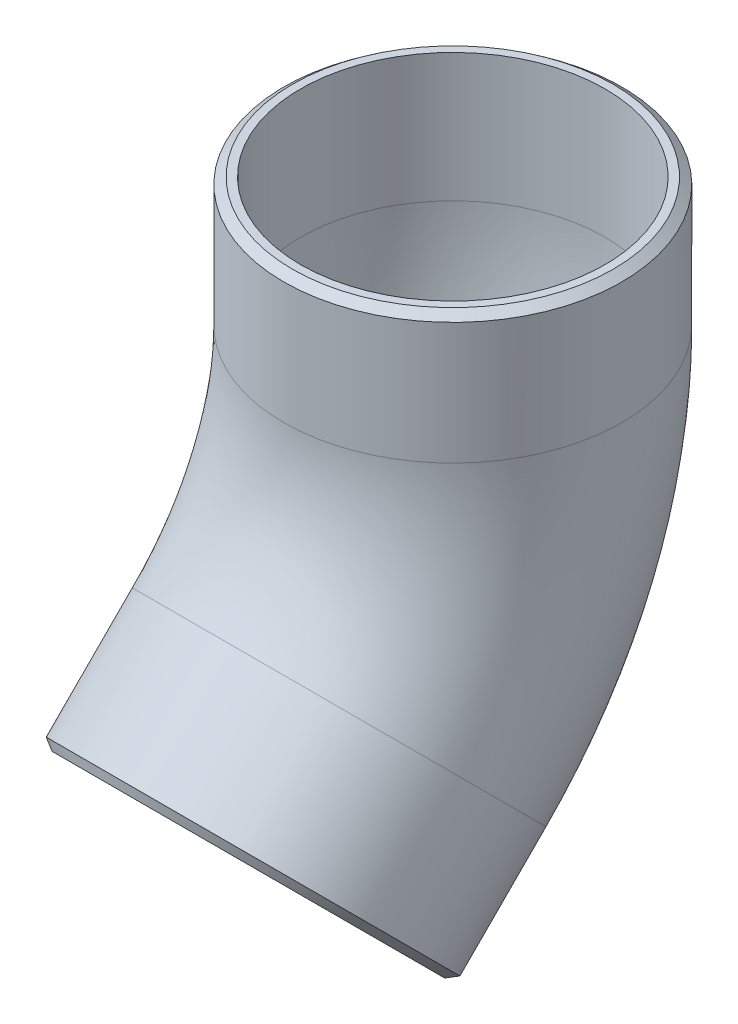
ISO-10303-21;
HEADER;
FILE_DESCRIPTION(('STEP AP214'),'2;1');
FILE_NAME('part.step','',(''),(''),'','','');
FILE_SCHEMA(('AUTOMOTIVE_DESIGN { 1 0 10303 214 1 1 1 1 }'));
ENDSEC;
DATA;
#1=APPLICATION_CONTEXT('core data for automotive mechanical design processes');
#2=APPLICATION_PROTOCOL_DEFINITION('international standard','automotive_design',2000,#1);
#3=PRODUCT_CONTEXT('',#1,'mechanical');
#4=PRODUCT('Part','Part','',(#3));
#5=PRODUCT_RELATED_PRODUCT_CATEGORY('part','',(#4));
#6=PRODUCT_DEFINITION_FORMATION('','',#4);
#7=PRODUCT_DEFINITION_CONTEXT('part definition',#1,'design');
#8=PRODUCT_DEFINITION('design','',#6,#7);
#9=PRODUCT_DEFINITION_SHAPE('','',#8);
#10=(LENGTH_UNIT() NAMED_UNIT(*) SI_UNIT(.MILLI.,.METRE.));
#11=(NAMED_UNIT(*) PLANE_ANGLE_UNIT() SI_UNIT($,.RADIAN.));
#12=(NAMED_UNIT(*) SI_UNIT($,.STERADIAN.) SOLID_ANGLE_UNIT());
#13=UNCERTAINTY_MEASURE_WITH_UNIT(LENGTH_MEASURE(1.E-05),#10,'distance_accuracy_value','');
#14=(GEOMETRIC_REPRESENTATION_CONTEXT(3) GLOBAL_UNCERTAINTY_ASSIGNED_CONTEXT((#13)) GLOBAL_UNIT_ASSIGNED_CONTEXT((#10,
#11,#12)) REPRESENTATION_CONTEXT('',''));
#15=CARTESIAN_POINT('',(0.,0.,0.));
#16=DIRECTION('',(0.,0.,1.));
#17=DIRECTION('',(1.,0.,0.));
#18=AXIS2_PLACEMENT_3D('',#15,#16,#17);
#19=CARTESIAN_POINT('',(0.,0.437534868905284,4.7063635957291));
#20=DIRECTION('',(0.,-0.707106781186553,0.707106781186542));
#21=DIRECTION('',(0.,-0.707106781186542,-0.707106781186553));
#22=AXIS2_PLACEMENT_3D('',#19,#20,#21);
#23=CYLINDRICAL_SURFACE('',#22,1.5905238095238);
#24=CARTESIAN_POINT('',(0.,0.437534868905284,4.7063635957291));
#25=DIRECTION('',(0.,0.707106781186551,-0.707106781186544));
#26=DIRECTION('',(0.,0.707106781186544,0.707106781186551));
#27=AXIS2_PLACEMENT_3D('',#24,#25,#26);
#28=CIRCLE('',#27,1.5905238095238);
#29=CARTESIAN_POINT('',(0.,-0.687135302447651,3.58169342437616));
#30=VERTEX_POINT('',#29);
#31=EDGE_CURVE('E39',#30,#30,#28,.T.);
#32=ORIENTED_EDGE('',*,*,#31,.F.);
#33=EDGE_LOOP('',(#32));
#34=FACE_BOUND('',#33,.T.);
#35=CARTESIAN_POINT('',(0.,-0.373429664582787,5.51732812921716));
#36=DIRECTION('',(0.,0.707106781186553,-0.707106781186542));
#37=DIRECTION('',(0.,0.707106781186542,0.707106781186553));
#38=AXIS2_PLACEMENT_3D('',#35,#36,#37);
#39=CIRCLE('',#38,1.59052380952379);
#40=CARTESIAN_POINT('',(0.,0.751240506770138,6.64199830057011));
#41=VERTEX_POINT('',#40);
#42=EDGE_CURVE('E67',#41,#41,#39,.T.);
#43=ORIENTED_EDGE('',*,*,#42,.T.);
#44=EDGE_LOOP('',(#43));
#45=FACE_BOUND('',#44,.T.);
#46=ADVANCED_FACE('F33',(#34,#45),#23,.T.);
#47=CARTESIAN_POINT('',(0.,-0.417727618815595,5.56162608344997));
#48=DIRECTION('',(0.,0.707106781186551,-0.707106781186544));
#49=DIRECTION('',(0.,0.707106781186544,0.707106781186551));
#50=AXIS2_PLACEMENT_3D('',#47,#48,#49);
#51=PLANE('',#50);
#52=CARTESIAN_POINT('',(0.,-0.417727618815595,5.56162608344997));
#53=DIRECTION('',(0.,0.707106781186551,-0.707106781186544));
#54=DIRECTION('',(0.,0.707106781186544,0.707106781186551));
#55=AXIS2_PLACEMENT_3D('',#52,#53,#54);
#56=CIRCLE('',#55,1.43328571428571);
#57=CARTESIAN_POINT('',(0.,0.595758429133628,6.5751121313992));
#58=VERTEX_POINT('',#57);
#59=EDGE_CURVE('E10',#58,#58,#56,.T.);
#60=ORIENTED_EDGE('',*,*,#59,.T.);
#61=EDGE_LOOP('',(#60));
#62=FACE_BOUND('',#61,.T.);
#63=CARTESIAN_POINT('',(0.,-0.417727618815598,5.56162608344997));
#64=DIRECTION('',(0.,0.707106781186553,-0.707106781186542));
#65=DIRECTION('',(0.,0.707106781186542,0.707106781186553));
#66=AXIS2_PLACEMENT_3D('',#63,#64,#65);
#67=CIRCLE('',#66,1.50888095238094);
#68=CARTESIAN_POINT('',(0.,0.649212334616175,6.62856603688176));
#69=VERTEX_POINT('',#68);
#70=EDGE_CURVE('E64',#69,#69,#67,.T.);
#71=ORIENTED_EDGE('',*,*,#70,.F.);
#72=EDGE_LOOP('',(#71));
#73=FACE_BOUND('',#72,.T.);
#74=ADVANCED_FACE('F84',(#62,#73),#51,.F.);
#75=CARTESIAN_POINT('',(0.,3.01851774046114,3.63728548607802));
#76=DIRECTION('',(0.,1.,0.));
#77=DIRECTION('',(0.,0.,1.));
#78=AXIS2_PLACEMENT_3D('',#75,#76,#77);
#79=CYLINDRICAL_SURFACE('',#78,1.5905238095238);
#80=CARTESIAN_POINT('',(0.,3.01851774046114,3.63728548607802));
#81=DIRECTION('',(0.,1.,0.));
#82=DIRECTION('',(0.,0.,1.));
#83=AXIS2_PLACEMENT_3D('',#80,#81,#82);
#84=CIRCLE('',#83,1.5905238095238);
#85=CARTESIAN_POINT('',(0.,3.01851774046114,2.04676167655422));
#86=VERTEX_POINT('',#85);
#87=EDGE_CURVE('E47',#86,#86,#84,.T.);
#88=ORIENTED_EDGE('',*,*,#87,.T.);
#89=EDGE_LOOP('',(#88));
#90=FACE_BOUND('',#89,.T.);
#91=CARTESIAN_POINT('',(0.,4.16539478232353,3.63728548607802));
#92=DIRECTION('',(0.,1.,0.));
#93=DIRECTION('',(0.,0.,1.));
#94=AXIS2_PLACEMENT_3D('',#91,#92,#93);
#95=CIRCLE('',#94,1.5905238095238);
#96=CARTESIAN_POINT('',(0.,4.16539478232353,5.22780929560182));
#97=VERTEX_POINT('',#96);
#98=EDGE_CURVE('E61',#97,#97,#95,.T.);
#99=ORIENTED_EDGE('',*,*,#98,.F.);
#100=EDGE_LOOP('',(#99));
#101=FACE_BOUND('',#100,.T.);
#102=ADVANCED_FACE('F89',(#90,#101),#79,.T.);
#103=CARTESIAN_POINT('',(0.,4.22804154998495,3.63728548607802));
#104=DIRECTION('',(0.,1.,0.));
#105=DIRECTION('',(0.,0.,1.));
#106=AXIS2_PLACEMENT_3D('',#103,#104,#105);
#107=PLANE('',#106);
#108=CARTESIAN_POINT('',(0.,4.22804154998495,3.63728548607802));
#109=DIRECTION('',(0.,1.,0.));
#110=DIRECTION('',(0.,0.,1.));
#111=AXIS2_PLACEMENT_3D('',#108,#109,#110);
#112=CIRCLE('',#111,1.43328571428571);
#113=CARTESIAN_POINT('',(0.,4.22804154998495,5.07057120036372));
#114=VERTEX_POINT('',#113);
#115=EDGE_CURVE('E50',#114,#114,#112,.T.);
#116=ORIENTED_EDGE('',*,*,#115,.F.);
#117=EDGE_LOOP('',(#116));
#118=FACE_BOUND('',#117,.T.);
#119=CARTESIAN_POINT('',(0.,4.22804154998495,3.63728548607802));
#120=DIRECTION('',(0.,1.,0.));
#121=DIRECTION('',(0.,0.,1.));
#122=AXIS2_PLACEMENT_3D('',#119,#120,#121);
#123=CIRCLE('',#122,1.50888095238094);
#124=CARTESIAN_POINT('',(0.,4.22804154998495,5.14616643845896));
#125=VERTEX_POINT('',#124);
#126=EDGE_CURVE('E54',#125,#125,#123,.T.);
#127=ORIENTED_EDGE('',*,*,#126,.T.);
#128=EDGE_LOOP('',(#127));
#129=FACE_BOUND('',#128,.T.);
#130=ADVANCED_FACE('F94',(#118,#129),#107,.T.);
#131=CARTESIAN_POINT('',(0.,0.437534868905284,4.7063635957291));
#132=DIRECTION('',(0.,-0.707106781186553,0.707106781186542));
#133=DIRECTION('',(0.,-0.707106781186542,-0.707106781186553));
#134=AXIS2_PLACEMENT_3D('',#131,#132,#133);
#135=CYLINDRICAL_SURFACE('',#134,1.43328571428571);
#136=CARTESIAN_POINT('',(0.,0.437534868905284,4.7063635957291));
#137=DIRECTION('',(0.,0.707106781186551,-0.707106781186544));
#138=DIRECTION('',(0.,0.707106781186544,0.707106781186551));
#139=AXIS2_PLACEMENT_3D('',#136,#137,#138);
#140=CIRCLE('',#139,1.43328571428571);
#141=CARTESIAN_POINT('',(0.,-0.575951179043938,3.69287754777987));
#142=VERTEX_POINT('',#141);
#143=EDGE_CURVE('E43',#142,#142,#140,.T.);
#144=ORIENTED_EDGE('',*,*,#143,.T.);
#145=EDGE_LOOP('',(#144));
#146=FACE_BOUND('',#145,.T.);
#147=ORIENTED_EDGE('',*,*,#59,.F.);
#148=EDGE_LOOP('',(#147));
#149=FACE_BOUND('',#148,.T.);
#150=ADVANCED_FACE('F100',(#146,#149),#135,.F.);
#151=CARTESIAN_POINT('',(0.,3.01851774046114,7.28734646728499));
#152=DIRECTION('',(-1.,0.,0.));
#153=DIRECTION('',(0.,0.,1.));
#154=AXIS2_PLACEMENT_3D('',#151,#152,#153);
#155=TOROIDAL_SURFACE('',#154,3.65006098120697,1.5905238095238);
#156=CARTESIAN_POINT('',(0.,3.01851774046114,7.28734646728499));
#157=DIRECTION('',(-1.,0.,0.));
#158=DIRECTION('',(0.,0.,1.));
#159=AXIS2_PLACEMENT_3D('',#156,#157,#158);
#160=CIRCLE('',#159,5.24058479073077);
#161=EDGE_CURVE('',#86,#30,#160,.T.);
#162=ORIENTED_EDGE('',*,*,#87,.F.);
#163=ORIENTED_EDGE('',*,*,#31,.T.);
#164=ORIENTED_EDGE('',*,*,#161,.T.);
#165=ORIENTED_EDGE('',*,*,#161,.F.);
#166=EDGE_LOOP('',(#162,#164,#163,#165));
#167=FACE_BOUND('',#166,.T.);
#168=ADVANCED_FACE('F109',(#167),#155,.T.);
#169=CARTESIAN_POINT('',(0.,3.01851774046114,7.28734646728499));
#170=DIRECTION('',(-1.,0.,0.));
#171=DIRECTION('',(0.,0.,1.));
#172=AXIS2_PLACEMENT_3D('',#169,#170,#171);
#173=TOROIDAL_SURFACE('',#172,3.65006098120697,1.43328571428571);
#174=CARTESIAN_POINT('',(0.,3.01851774046114,3.63728548607802));
#175=DIRECTION('',(0.,1.,0.));
#176=DIRECTION('',(0.,0.,1.));
#177=AXIS2_PLACEMENT_3D('',#174,#175,#176);
#178=CIRCLE('',#177,1.43328571428571);
#179=CARTESIAN_POINT('',(0.,3.01851774046114,2.20399977179231));
#180=VERTEX_POINT('',#179);
#181=EDGE_CURVE('E53',#180,#180,#178,.T.);
#182=CARTESIAN_POINT('',(0.,3.01851774046114,7.28734646728499));
#183=DIRECTION('',(-1.,0.,0.));
#184=DIRECTION('',(0.,0.,1.));
#185=AXIS2_PLACEMENT_3D('',#182,#183,#184);
#186=CIRCLE('',#185,5.08334669549267);
#187=EDGE_CURVE('',#180,#142,#186,.T.);
#188=ORIENTED_EDGE('',*,*,#181,.T.);
#189=ORIENTED_EDGE('',*,*,#143,.F.);
#190=ORIENTED_EDGE('',*,*,#187,.T.);
#191=ORIENTED_EDGE('',*,*,#187,.F.);
#192=EDGE_LOOP('',(#188,#190,#189,#191));
#193=FACE_BOUND('',#192,.T.);
#194=ADVANCED_FACE('F105',(#193),#173,.F.);
#195=CARTESIAN_POINT('',(0.,3.01851774046114,3.63728548607802));
#196=DIRECTION('',(0.,1.,0.));
#197=DIRECTION('',(0.,0.,1.));
#198=AXIS2_PLACEMENT_3D('',#195,#196,#197);
#199=CYLINDRICAL_SURFACE('',#198,1.43328571428571);
#200=ORIENTED_EDGE('',*,*,#181,.F.);
#201=EDGE_LOOP('',(#200));
#202=FACE_BOUND('',#201,.T.);
#203=ORIENTED_EDGE('',*,*,#115,.T.);
#204=EDGE_LOOP('',(#203));
#205=FACE_BOUND('',#204,.T.);
#206=ADVANCED_FACE('F80',(#202,#205),#199,.F.);
#207=CARTESIAN_POINT('',(0.,4.22804154998495,3.63728548607802));
#208=DIRECTION('',(0.,-1.,0.));
#209=DIRECTION('',(0.,0.,-1.));
#210=AXIS2_PLACEMENT_3D('',#207,#208,#209);
#211=CONICAL_SURFACE('',#210,1.50888095238094,0.916297857297027);
#212=ORIENTED_EDGE('',*,*,#98,.T.);
#213=EDGE_LOOP('',(#212));
#214=FACE_BOUND('',#213,.T.);
#215=ORIENTED_EDGE('',*,*,#126,.F.);
#216=EDGE_LOOP('',(#215));
#217=FACE_BOUND('',#216,.T.);
#218=ADVANCED_FACE('F74',(#214,#217),#211,.T.);
#219=CARTESIAN_POINT('',(0.,-0.373429664582787,5.51732812921716));
#220=DIRECTION('',(0.,0.707106781186553,-0.707106781186542));
#221=DIRECTION('',(0.,0.707106781186542,0.707106781186553));
#222=AXIS2_PLACEMENT_3D('',#219,#220,#221);
#223=CONICAL_SURFACE('',#222,1.59052380952379,0.916297857296973);
#224=ORIENTED_EDGE('',*,*,#70,.T.);
#225=EDGE_LOOP('',(#224));
#226=FACE_BOUND('',#225,.T.);
#227=ORIENTED_EDGE('',*,*,#42,.F.);
#228=EDGE_LOOP('',(#227));
#229=FACE_BOUND('',#228,.T.);
#230=ADVANCED_FACE('F72',(#226,#229),#223,.T.);
#231=CLOSED_SHELL('',(#46,#74,#102,#130,#150,#168,#194,#206,#218,#230));
#232=MANIFOLD_SOLID_BREP('B2',#231);
#233=ADVANCED_BREP_SHAPE_REPRESENTATION('',(#18,#232),#14);
#234=SHAPE_DEFINITION_REPRESENTATION(#9,#233);
ENDSEC;
END-ISO-10303-21;
